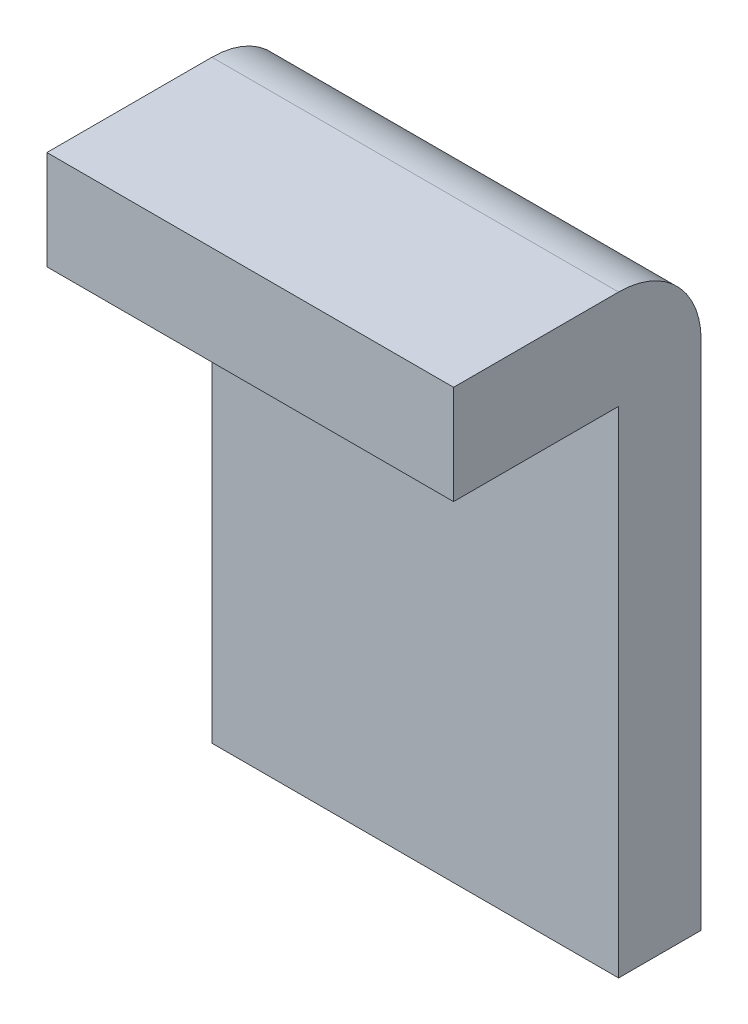
ISO-10303-21;
HEADER;
FILE_DESCRIPTION(('STEP AP214'),'2;1');
FILE_NAME('part.step','',(''),(''),'','','');
FILE_SCHEMA(('AUTOMOTIVE_DESIGN { 1 0 10303 214 1 1 1 1 }'));
ENDSEC;
DATA;
#1=APPLICATION_CONTEXT('core data for automotive mechanical design processes');
#2=APPLICATION_PROTOCOL_DEFINITION('international standard','automotive_design',2000,#1);
#3=PRODUCT_CONTEXT('',#1,'mechanical');
#4=PRODUCT('Part','Part','',(#3));
#5=PRODUCT_RELATED_PRODUCT_CATEGORY('part','',(#4));
#6=PRODUCT_DEFINITION_FORMATION('','',#4);
#7=PRODUCT_DEFINITION_CONTEXT('part definition',#1,'design');
#8=PRODUCT_DEFINITION('design','',#6,#7);
#9=PRODUCT_DEFINITION_SHAPE('','',#8);
#10=(LENGTH_UNIT() NAMED_UNIT(*) SI_UNIT(.MILLI.,.METRE.));
#11=(NAMED_UNIT(*) PLANE_ANGLE_UNIT() SI_UNIT($,.RADIAN.));
#12=(NAMED_UNIT(*) SI_UNIT($,.STERADIAN.) SOLID_ANGLE_UNIT());
#13=UNCERTAINTY_MEASURE_WITH_UNIT(LENGTH_MEASURE(1.E-05),#10,'distance_accuracy_value','');
#14=(GEOMETRIC_REPRESENTATION_CONTEXT(3) GLOBAL_UNCERTAINTY_ASSIGNED_CONTEXT((#13)) GLOBAL_UNIT_ASSIGNED_CONTEXT((#10,
#11,#12)) REPRESENTATION_CONTEXT('',''));
#15=CARTESIAN_POINT('',(0.,0.,0.));
#16=DIRECTION('',(0.,0.,1.));
#17=DIRECTION('',(1.,0.,0.));
#18=AXIS2_PLACEMENT_3D('',#15,#16,#17);
#19=CARTESIAN_POINT('',(-8.34906661620967,8.30000000000001,4.25467377707551));
#20=DIRECTION('',(0.,1.,0.));
#21=DIRECTION('',(0.,0.,1.));
#22=AXIS2_PLACEMENT_3D('',#19,#20,#21);
#23=PLANE('',#22);
#24=DIRECTION('',(1.,0.,0.));
#25=VECTOR('',#24,1.);
#26=CARTESIAN_POINT('',(14.1818701655721,8.30000000000001,4.25467377707551));
#27=LINE('',#26,#25);
#28=CARTESIAN_POINT('',(14.1818701655721,8.30000000000001,4.25467377707551));
#29=VERTEX_POINT('',#28);
#30=CARTESIAN_POINT('',(15.4140209220128,8.30000000000001,4.25467377707551));
#31=VERTEX_POINT('',#30);
#32=EDGE_CURVE('E133',#29,#31,#27,.T.);
#33=ORIENTED_EDGE('',*,*,#32,.F.);
#34=DIRECTION('',(0.,0.,1.));
#35=VECTOR('',#34,1.);
#36=CARTESIAN_POINT('',(14.1818701655721,8.30000000000001,4.25467377707552));
#37=LINE('',#36,#35);
#38=CARTESIAN_POINT('',(14.1818701655721,8.30000000000001,3.75467377707551));
#39=VERTEX_POINT('',#38);
#40=EDGE_CURVE('E113',#39,#29,#37,.T.);
#41=ORIENTED_EDGE('',*,*,#40,.F.);
#42=DIRECTION('',(1.,0.,0.));
#43=VECTOR('',#42,1.);
#44=CARTESIAN_POINT('',(-8.34906661620967,8.30000000000001,3.75467377707551));
#45=LINE('',#44,#43);
#46=CARTESIAN_POINT('',(15.4140209220128,8.30000000000001,3.75467377707551));
#47=VERTEX_POINT('',#46);
#48=EDGE_CURVE('E130',#39,#47,#45,.T.);
#49=ORIENTED_EDGE('',*,*,#48,.T.);
#50=DIRECTION('',(0.,0.,-1.));
#51=VECTOR('',#50,1.);
#52=CARTESIAN_POINT('',(15.4140209220128,8.30000000000001,4.25467377707552));
#53=LINE('',#52,#51);
#54=EDGE_CURVE('E129',#31,#47,#53,.T.);
#55=ORIENTED_EDGE('',*,*,#54,.F.);
#56=EDGE_LOOP('',(#33,#41,#49,#55));
#57=FACE_BOUND('',#56,.T.);
#58=ADVANCED_FACE('F17',(#57),#23,.F.);
#59=CARTESIAN_POINT('',(14.1818701655721,5.35753839337144,4.25467377707552));
#60=DIRECTION('',(0.,0.,1.));
#61=DIRECTION('',(0.,-1.,0.));
#62=AXIS2_PLACEMENT_3D('',#59,#60,#61);
#63=PLANE('',#62);
#64=DIRECTION('',(1.,0.,0.));
#65=VECTOR('',#64,1.);
#66=CARTESIAN_POINT('',(-8.34906661620967,8.6,4.25467377707551));
#67=LINE('',#66,#65);
#68=CARTESIAN_POINT('',(15.4140209220128,8.6,4.25467377707551));
#69=VERTEX_POINT('',#68);
#70=CARTESIAN_POINT('',(14.1818701655721,8.6,4.25467377707551));
#71=VERTEX_POINT('',#70);
#72=EDGE_CURVE('E131',#69,#71,#67,.F.);
#73=ORIENTED_EDGE('',*,*,#72,.T.);
#74=DIRECTION('',(0.,1.,0.));
#75=VECTOR('',#74,1.);
#76=CARTESIAN_POINT('',(14.1818701655721,5.35753839337144,4.25467377707551));
#77=LINE('',#76,#75);
#78=EDGE_CURVE('E136',#29,#71,#77,.T.);
#79=ORIENTED_EDGE('',*,*,#78,.F.);
#80=ORIENTED_EDGE('',*,*,#32,.T.);
#81=DIRECTION('',(0.,1.,0.));
#82=VECTOR('',#81,1.);
#83=CARTESIAN_POINT('',(15.4140209220128,5.35753839337144,4.25467377707551));
#84=LINE('',#83,#82);
#85=EDGE_CURVE('E120',#69,#31,#84,.F.);
#86=ORIENTED_EDGE('',*,*,#85,.F.);
#87=EDGE_LOOP('',(#73,#79,#80,#86));
#88=FACE_BOUND('',#87,.T.);
#89=ADVANCED_FACE('F172',(#88),#63,.T.);
#90=CARTESIAN_POINT('',(-8.34906661620967,8.6,4.25467377707551));
#91=DIRECTION('',(0.,-1.,0.));
#92=DIRECTION('',(0.,0.,-1.));
#93=AXIS2_PLACEMENT_3D('',#90,#91,#92);
#94=PLANE('',#93);
#95=DIRECTION('',(1.,0.,0.));
#96=VECTOR('',#95,1.);
#97=CARTESIAN_POINT('',(-8.34906661620967,8.6,3.75467377707551));
#98=LINE('',#97,#96);
#99=CARTESIAN_POINT('',(14.1818701655721,8.6,3.7546737770755));
#100=VERTEX_POINT('',#99);
#101=CARTESIAN_POINT('',(15.4140209220128,8.6,3.7546737770755));
#102=VERTEX_POINT('',#101);
#103=EDGE_CURVE('E79',#100,#102,#98,.T.);
#104=ORIENTED_EDGE('',*,*,#103,.F.);
#105=DIRECTION('',(0.,0.,1.));
#106=VECTOR('',#105,1.);
#107=CARTESIAN_POINT('',(14.1818701655721,8.6,4.25467377707552));
#108=LINE('',#107,#106);
#109=EDGE_CURVE('E139',#71,#100,#108,.F.);
#110=ORIENTED_EDGE('',*,*,#109,.F.);
#111=ORIENTED_EDGE('',*,*,#72,.F.);
#112=DIRECTION('',(0.,0.,-1.));
#113=VECTOR('',#112,1.);
#114=CARTESIAN_POINT('',(15.4140209220128,8.6,4.25467377707552));
#115=LINE('',#114,#113);
#116=EDGE_CURVE('E83',#102,#69,#115,.F.);
#117=ORIENTED_EDGE('',*,*,#116,.F.);
#118=EDGE_LOOP('',(#104,#110,#111,#117));
#119=FACE_BOUND('',#118,.T.);
#120=ADVANCED_FACE('F169',(#119),#94,.F.);
#121=CARTESIAN_POINT('',(-8.34906661620967,8.30000000000001,3.75467377707551));
#122=DIRECTION('',(0.,0.,-1.));
#123=DIRECTION('',(0.,1.,0.));
#124=AXIS2_PLACEMENT_3D('',#121,#122,#123);
#125=PLANE('',#124);
#126=ORIENTED_EDGE('',*,*,#48,.F.);
#127=DIRECTION('',(0.,1.,0.));
#128=VECTOR('',#127,1.);
#129=CARTESIAN_POINT('',(14.1818701655721,5.35753839337144,3.75467377707551));
#130=LINE('',#129,#128);
#131=CARTESIAN_POINT('',(14.1818701655721,6.8,3.75467377707551));
#132=VERTEX_POINT('',#131);
#133=EDGE_CURVE('E95',#132,#39,#130,.T.);
#134=ORIENTED_EDGE('',*,*,#133,.F.);
#135=DIRECTION('',(1.,0.,0.));
#136=VECTOR('',#135,1.);
#137=CARTESIAN_POINT('',(-15.8147962412963,6.8,3.75467377707551));
#138=LINE('',#137,#136);
#139=CARTESIAN_POINT('',(15.4140209220128,6.8,3.75467377707551));
#140=VERTEX_POINT('',#139);
#141=EDGE_CURVE('E114',#140,#132,#138,.F.);
#142=ORIENTED_EDGE('',*,*,#141,.F.);
#143=DIRECTION('',(0.,1.,0.));
#144=VECTOR('',#143,1.);
#145=CARTESIAN_POINT('',(15.4140209220128,5.35753839337144,3.75467377707551));
#146=LINE('',#145,#144);
#147=EDGE_CURVE('E84',#47,#140,#146,.F.);
#148=ORIENTED_EDGE('',*,*,#147,.F.);
#149=EDGE_LOOP('',(#126,#134,#142,#148));
#150=FACE_BOUND('',#149,.T.);
#151=ADVANCED_FACE('F178',(#150),#125,.F.);
#152=CARTESIAN_POINT('',(-8.34906661620967,8.35,3.7546737770755));
#153=DIRECTION('',(1.,0.,0.));
#154=DIRECTION('',(0.,0.,-1.));
#155=AXIS2_PLACEMENT_3D('',#152,#153,#154);
#156=CYLINDRICAL_SURFACE('',#155,0.249999999999996);
#157=CARTESIAN_POINT('',(14.1818701655721,8.35,3.7546737770755));
#158=DIRECTION('',(1.,0.,0.));
#159=DIRECTION('',(0.,0.,-1.));
#160=AXIS2_PLACEMENT_3D('',#157,#158,#159);
#161=CIRCLE('',#160,0.249999999999996);
#162=CARTESIAN_POINT('',(14.1818701655721,8.35,3.50467377707551));
#163=VERTEX_POINT('',#162);
#164=EDGE_CURVE('E106',#100,#163,#161,.F.);
#165=ORIENTED_EDGE('',*,*,#164,.F.);
#166=ORIENTED_EDGE('',*,*,#103,.T.);
#167=CARTESIAN_POINT('',(15.4140209220128,8.35,3.7546737770755));
#168=DIRECTION('',(1.,0.,0.));
#169=DIRECTION('',(0.,0.,-1.));
#170=AXIS2_PLACEMENT_3D('',#167,#168,#169);
#171=CIRCLE('',#170,0.249999999999996);
#172=CARTESIAN_POINT('',(15.4140209220128,8.35,3.50467377707551));
#173=VERTEX_POINT('',#172);
#174=EDGE_CURVE('E20',#173,#102,#171,.T.);
#175=ORIENTED_EDGE('',*,*,#174,.F.);
#176=DIRECTION('',(1.,0.,0.));
#177=VECTOR('',#176,1.);
#178=CARTESIAN_POINT('',(14.1818701655721,8.35,3.50467377707551));
#179=LINE('',#178,#177);
#180=EDGE_CURVE('E77',#163,#173,#179,.T.);
#181=ORIENTED_EDGE('',*,*,#180,.F.);
#182=EDGE_LOOP('',(#165,#166,#175,#181));
#183=FACE_BOUND('',#182,.T.);
#184=ADVANCED_FACE('F75',(#183),#156,.T.);
#185=CARTESIAN_POINT('',(15.4140209220128,5.35753839337144,4.25467377707552));
#186=DIRECTION('',(1.,0.,0.));
#187=DIRECTION('',(0.,0.,-1.));
#188=AXIS2_PLACEMENT_3D('',#185,#186,#187);
#189=PLANE('',#188);
#190=ORIENTED_EDGE('',*,*,#116,.T.);
#191=ORIENTED_EDGE('',*,*,#85,.T.);
#192=ORIENTED_EDGE('',*,*,#54,.T.);
#193=ORIENTED_EDGE('',*,*,#147,.T.);
#194=DIRECTION('',(0.,0.,-1.));
#195=VECTOR('',#194,1.);
#196=CARTESIAN_POINT('',(15.4140209220128,6.80000000000003,12.5046737770755));
#197=LINE('',#196,#195);
#198=CARTESIAN_POINT('',(15.4140209220128,6.8,3.50467377707552));
#199=VERTEX_POINT('',#198);
#200=EDGE_CURVE('E90',#199,#140,#197,.F.);
#201=ORIENTED_EDGE('',*,*,#200,.F.);
#202=DIRECTION('',(0.,1.,0.));
#203=VECTOR('',#202,1.);
#204=CARTESIAN_POINT('',(15.4140209220128,5.35753839337143,3.50467377707552));
#205=LINE('',#204,#203);
#206=EDGE_CURVE('E86',#173,#199,#205,.F.);
#207=ORIENTED_EDGE('',*,*,#206,.F.);
#208=ORIENTED_EDGE('',*,*,#174,.T.);
#209=EDGE_LOOP('',(#190,#191,#192,#193,#201,#207,#208));
#210=FACE_BOUND('',#209,.T.);
#211=ADVANCED_FACE('F87',(#210),#189,.T.);
#212=CARTESIAN_POINT('',(-15.8147962412963,6.80000000000003,12.5046737770755));
#213=DIRECTION('',(0.,-1.,0.));
#214=DIRECTION('',(0.,0.,-1.));
#215=AXIS2_PLACEMENT_3D('',#212,#213,#214);
#216=PLANE('',#215);
#217=DIRECTION('',(1.,0.,0.));
#218=VECTOR('',#217,1.);
#219=CARTESIAN_POINT('',(14.1818701655721,6.8,3.50467377707552));
#220=LINE('',#219,#218);
#221=CARTESIAN_POINT('',(14.1818701655721,6.8,3.50467377707552));
#222=VERTEX_POINT('',#221);
#223=EDGE_CURVE('E26',#199,#222,#220,.F.);
#224=ORIENTED_EDGE('',*,*,#223,.F.);
#225=ORIENTED_EDGE('',*,*,#200,.T.);
#226=ORIENTED_EDGE('',*,*,#141,.T.);
#227=DIRECTION('',(0.,0.,1.));
#228=VECTOR('',#227,1.);
#229=CARTESIAN_POINT('',(14.1818701655721,6.8,4.25467377707552));
#230=LINE('',#229,#228);
#231=EDGE_CURVE('E35',#222,#132,#230,.T.);
#232=ORIENTED_EDGE('',*,*,#231,.F.);
#233=EDGE_LOOP('',(#224,#225,#226,#232));
#234=FACE_BOUND('',#233,.T.);
#235=ADVANCED_FACE('F179',(#234),#216,.T.);
#236=CARTESIAN_POINT('',(14.1818701655721,5.35753839337144,4.25467377707552));
#237=DIRECTION('',(-1.,0.,0.));
#238=DIRECTION('',(0.,0.,1.));
#239=AXIS2_PLACEMENT_3D('',#236,#237,#238);
#240=PLANE('',#239);
#241=ORIENTED_EDGE('',*,*,#231,.T.);
#242=ORIENTED_EDGE('',*,*,#133,.T.);
#243=ORIENTED_EDGE('',*,*,#40,.T.);
#244=ORIENTED_EDGE('',*,*,#78,.T.);
#245=ORIENTED_EDGE('',*,*,#109,.T.);
#246=ORIENTED_EDGE('',*,*,#164,.T.);
#247=DIRECTION('',(0.,1.,0.));
#248=VECTOR('',#247,1.);
#249=CARTESIAN_POINT('',(14.1818701655721,5.35753839337143,3.50467377707552));
#250=LINE('',#249,#248);
#251=EDGE_CURVE('E11',#222,#163,#250,.T.);
#252=ORIENTED_EDGE('',*,*,#251,.F.);
#253=EDGE_LOOP('',(#241,#242,#243,#244,#245,#246,#252));
#254=FACE_BOUND('',#253,.T.);
#255=ADVANCED_FACE('F166',(#254),#240,.T.);
#256=CARTESIAN_POINT('',(14.1818701655721,5.35753839337143,3.50467377707552));
#257=DIRECTION('',(0.,0.,-1.));
#258=DIRECTION('',(0.,1.,0.));
#259=AXIS2_PLACEMENT_3D('',#256,#257,#258);
#260=PLANE('',#259);
#261=ORIENTED_EDGE('',*,*,#223,.T.);
#262=ORIENTED_EDGE('',*,*,#251,.T.);
#263=ORIENTED_EDGE('',*,*,#180,.T.);
#264=ORIENTED_EDGE('',*,*,#206,.T.);
#265=EDGE_LOOP('',(#261,#262,#263,#264));
#266=FACE_BOUND('',#265,.T.);
#267=ADVANCED_FACE('F94',(#266),#260,.T.);
#268=CLOSED_SHELL('',(#58,#89,#120,#151,#184,#211,#235,#255,#267));
#269=MANIFOLD_SOLID_BREP('B1',#268);
#270=ADVANCED_BREP_SHAPE_REPRESENTATION('',(#18,#269),#14);
#271=SHAPE_DEFINITION_REPRESENTATION(#9,#270);
ENDSEC;
END-ISO-10303-21;
